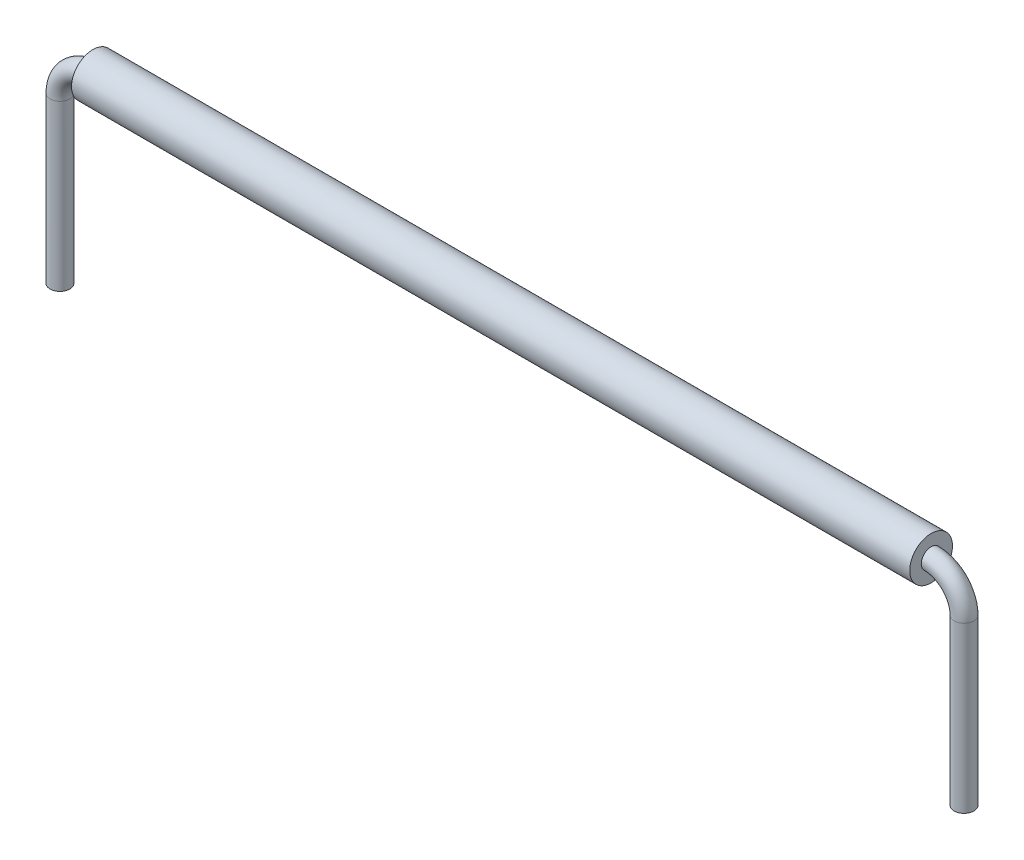
ISO-10303-21;
HEADER;
FILE_DESCRIPTION(('STEP AP214'),'2;1');
FILE_NAME('part.step','',(''),(''),'','','');
FILE_SCHEMA(('AUTOMOTIVE_DESIGN { 1 0 10303 214 1 1 1 1 }'));
ENDSEC;
DATA;
#1=APPLICATION_CONTEXT('core data for automotive mechanical design processes');
#2=APPLICATION_PROTOCOL_DEFINITION('international standard','automotive_design',2000,#1);
#3=PRODUCT_CONTEXT('',#1,'mechanical');
#4=PRODUCT('Part','Part','',(#3));
#5=PRODUCT_RELATED_PRODUCT_CATEGORY('part','',(#4));
#6=PRODUCT_DEFINITION_FORMATION('','',#4);
#7=PRODUCT_DEFINITION_CONTEXT('part definition',#1,'design');
#8=PRODUCT_DEFINITION('design','',#6,#7);
#9=PRODUCT_DEFINITION_SHAPE('','',#8);
#10=(LENGTH_UNIT() NAMED_UNIT(*) SI_UNIT(.MILLI.,.METRE.));
#11=(NAMED_UNIT(*) PLANE_ANGLE_UNIT() SI_UNIT($,.RADIAN.));
#12=(NAMED_UNIT(*) SI_UNIT($,.STERADIAN.) SOLID_ANGLE_UNIT());
#13=UNCERTAINTY_MEASURE_WITH_UNIT(LENGTH_MEASURE(1.E-05),#10,'distance_accuracy_value','');
#14=(GEOMETRIC_REPRESENTATION_CONTEXT(3) GLOBAL_UNCERTAINTY_ASSIGNED_CONTEXT((#13)) GLOBAL_UNIT_ASSIGNED_CONTEXT((#10,
#11,#12)) REPRESENTATION_CONTEXT('',''));
#15=CARTESIAN_POINT('',(0.,0.,0.));
#16=DIRECTION('',(0.,0.,1.));
#17=DIRECTION('',(1.,0.,0.));
#18=AXIS2_PLACEMENT_3D('',#15,#16,#17);
#19=CARTESIAN_POINT('',(12.7275,0.,0.));
#20=DIRECTION('',(1.,0.,0.));
#21=DIRECTION('',(0.,0.,-1.));
#22=AXIS2_PLACEMENT_3D('',#19,#20,#21);
#23=PLANE('',#22);
#24=CARTESIAN_POINT('',(12.7275,0.,0.));
#25=DIRECTION('',(1.,0.,0.));
#26=DIRECTION('',(0.,0.,-1.));
#27=AXIS2_PLACEMENT_3D('',#24,#25,#26);
#28=CIRCLE('',#27,0.65);
#29=CARTESIAN_POINT('',(12.7275,0.,-0.65));
#30=VERTEX_POINT('',#29);
#31=EDGE_CURVE('E11',#30,#30,#28,.T.);
#32=ORIENTED_EDGE('',*,*,#31,.T.);
#33=EDGE_LOOP('',(#32));
#34=FACE_BOUND('',#33,.T.);
#35=CARTESIAN_POINT('',(12.7275,0.,0.));
#36=DIRECTION('',(1.,0.,0.));
#37=DIRECTION('',(0.,0.,-1.));
#38=AXIS2_PLACEMENT_3D('',#35,#36,#37);
#39=CIRCLE('',#38,0.3);
#40=CARTESIAN_POINT('',(12.7275,0.,-0.3));
#41=VERTEX_POINT('',#40);
#42=EDGE_CURVE('E52',#41,#41,#39,.T.);
#43=ORIENTED_EDGE('',*,*,#42,.F.);
#44=EDGE_LOOP('',(#43));
#45=FACE_BOUND('',#44,.T.);
#46=ADVANCED_FACE('F45',(#34,#45),#23,.T.);
#47=CARTESIAN_POINT('',(12.7275,0.,0.));
#48=DIRECTION('',(-1.,0.,0.));
#49=DIRECTION('',(0.,0.,1.));
#50=AXIS2_PLACEMENT_3D('',#47,#48,#49);
#51=CYLINDRICAL_SURFACE('',#50,0.65);
#52=ORIENTED_EDGE('',*,*,#31,.F.);
#53=EDGE_LOOP('',(#52));
#54=FACE_BOUND('',#53,.T.);
#55=CARTESIAN_POINT('',(-12.7275,0.,0.));
#56=DIRECTION('',(1.,0.,0.));
#57=DIRECTION('',(0.,0.,-1.));
#58=AXIS2_PLACEMENT_3D('',#55,#56,#57);
#59=CIRCLE('',#58,0.65);
#60=CARTESIAN_POINT('',(-12.7275,0.,-0.65));
#61=VERTEX_POINT('',#60);
#62=EDGE_CURVE('E56',#61,#61,#59,.T.);
#63=ORIENTED_EDGE('',*,*,#62,.T.);
#64=EDGE_LOOP('',(#63));
#65=FACE_BOUND('',#64,.T.);
#66=ADVANCED_FACE('F47',(#54,#65),#51,.T.);
#67=CARTESIAN_POINT('',(12.7275,0.,0.));
#68=DIRECTION('',(-1.,0.,0.));
#69=DIRECTION('',(0.,0.,1.));
#70=AXIS2_PLACEMENT_3D('',#67,#68,#69);
#71=CYLINDRICAL_SURFACE('',#70,0.3);
#72=ORIENTED_EDGE('',*,*,#42,.T.);
#73=EDGE_LOOP('',(#72));
#74=FACE_BOUND('',#73,.T.);
#75=CARTESIAN_POINT('',(-12.7275,0.,0.));
#76=DIRECTION('',(1.,0.,0.));
#77=DIRECTION('',(0.,0.,-1.));
#78=AXIS2_PLACEMENT_3D('',#75,#76,#77);
#79=CIRCLE('',#78,0.3);
#80=CARTESIAN_POINT('',(-12.7275,0.,-0.3));
#81=VERTEX_POINT('',#80);
#82=EDGE_CURVE('E60',#81,#81,#79,.T.);
#83=ORIENTED_EDGE('',*,*,#82,.F.);
#84=EDGE_LOOP('',(#83));
#85=FACE_BOUND('',#84,.T.);
#86=ADVANCED_FACE('F69',(#74,#85),#71,.F.);
#87=CARTESIAN_POINT('',(-12.7275,0.,0.));
#88=DIRECTION('',(1.,0.,0.));
#89=DIRECTION('',(0.,0.,-1.));
#90=AXIS2_PLACEMENT_3D('',#87,#88,#89);
#91=PLANE('',#90);
#92=ORIENTED_EDGE('',*,*,#82,.T.);
#93=EDGE_LOOP('',(#92));
#94=FACE_BOUND('',#93,.T.);
#95=ORIENTED_EDGE('',*,*,#62,.F.);
#96=EDGE_LOOP('',(#95));
#97=FACE_BOUND('',#96,.T.);
#98=ADVANCED_FACE('F66',(#94,#97),#91,.F.);
#99=CLOSED_SHELL('',(#46,#66,#86,#98));
#100=MANIFOLD_SOLID_BREP('B2',#99);
#101=CARTESIAN_POINT('',(13.7275,-6.,0.));
#102=DIRECTION('',(0.,-1.,0.));
#103=DIRECTION('',(0.,0.,-1.));
#104=AXIS2_PLACEMENT_3D('',#101,#102,#103);
#105=PLANE('',#104);
#106=CARTESIAN_POINT('',(13.7275,-6.,0.));
#107=DIRECTION('',(0.,-1.,0.));
#108=DIRECTION('',(0.,0.,-1.));
#109=AXIS2_PLACEMENT_3D('',#106,#107,#108);
#110=CIRCLE('',#109,0.3);
#111=CARTESIAN_POINT('',(13.7275,-6.,-0.3));
#112=VERTEX_POINT('',#111);
#113=EDGE_CURVE('E129',#112,#112,#110,.T.);
#114=ORIENTED_EDGE('',*,*,#113,.T.);
#115=EDGE_LOOP('',(#114));
#116=FACE_BOUND('',#115,.T.);
#117=ADVANCED_FACE('F107',(#116),#105,.T.);
#118=CARTESIAN_POINT('',(-13.7275,-6.,0.));
#119=DIRECTION('',(0.,1.,0.));
#120=DIRECTION('',(0.,0.,-1.));
#121=AXIS2_PLACEMENT_3D('',#118,#119,#120);
#122=PLANE('',#121);
#123=CARTESIAN_POINT('',(-13.7275,-6.,0.));
#124=DIRECTION('',(0.,1.,0.));
#125=DIRECTION('',(0.,0.,-1.));
#126=AXIS2_PLACEMENT_3D('',#123,#124,#125);
#127=CIRCLE('',#126,0.3);
#128=CARTESIAN_POINT('',(-13.7275,-6.,-0.3));
#129=VERTEX_POINT('',#128);
#130=EDGE_CURVE('E44',#129,#129,#127,.T.);
#131=ORIENTED_EDGE('',*,*,#130,.F.);
#132=EDGE_LOOP('',(#131));
#133=FACE_BOUND('',#132,.T.);
#134=ADVANCED_FACE('F137',(#133),#122,.F.);
#135=CARTESIAN_POINT('',(13.7275,-6.,0.));
#136=DIRECTION('',(0.,1.,0.));
#137=DIRECTION('',(-1.,0.,0.));
#138=AXIS2_PLACEMENT_3D('',#135,#136,#137);
#139=CYLINDRICAL_SURFACE('',#138,0.3);
#140=CARTESIAN_POINT('',(13.7275,-0.999999999999997,0.));
#141=DIRECTION('',(0.,-1.,0.));
#142=DIRECTION('',(0.,0.,-1.));
#143=AXIS2_PLACEMENT_3D('',#140,#141,#142);
#144=CIRCLE('',#143,0.3);
#145=CARTESIAN_POINT('',(14.0275,-0.999999999999997,0.));
#146=VERTEX_POINT('',#145);
#147=EDGE_CURVE('E126',#146,#146,#144,.T.);
#148=ORIENTED_EDGE('',*,*,#147,.T.);
#149=EDGE_LOOP('',(#148));
#150=FACE_BOUND('',#149,.T.);
#151=ORIENTED_EDGE('',*,*,#113,.F.);
#152=EDGE_LOOP('',(#151));
#153=FACE_BOUND('',#152,.T.);
#154=ADVANCED_FACE('F134',(#150,#153),#139,.T.);
#155=CARTESIAN_POINT('',(12.7275,-0.999999999999997,0.));
#156=DIRECTION('',(0.,0.,1.));
#157=DIRECTION('',(1.,0.,0.));
#158=AXIS2_PLACEMENT_3D('',#155,#156,#157);
#159=TOROIDAL_SURFACE('',#158,0.999999999999999,0.3);
#160=CARTESIAN_POINT('',(12.7275,0.,0.));
#161=DIRECTION('',(1.,0.,0.));
#162=DIRECTION('',(0.,0.,-1.));
#163=AXIS2_PLACEMENT_3D('',#160,#161,#162);
#164=CIRCLE('',#163,0.3);
#165=CARTESIAN_POINT('',(12.7275,0.300000000000002,0.));
#166=VERTEX_POINT('',#165);
#167=EDGE_CURVE('E121',#166,#166,#164,.T.);
#168=CARTESIAN_POINT('',(12.7275,-0.999999999999997,0.));
#169=DIRECTION('',(0.,0.,1.));
#170=DIRECTION('',(1.,0.,0.));
#171=AXIS2_PLACEMENT_3D('',#168,#169,#170);
#172=CIRCLE('',#171,1.3);
#173=EDGE_CURVE('',#146,#166,#172,.T.);
#174=ORIENTED_EDGE('',*,*,#147,.F.);
#175=ORIENTED_EDGE('',*,*,#167,.T.);
#176=ORIENTED_EDGE('',*,*,#173,.T.);
#177=ORIENTED_EDGE('',*,*,#173,.F.);
#178=EDGE_LOOP('',(#174,#176,#175,#177));
#179=FACE_BOUND('',#178,.T.);
#180=ADVANCED_FACE('F136',(#179),#159,.T.);
#181=CARTESIAN_POINT('',(12.7275,0.,0.));
#182=DIRECTION('',(-1.,0.,0.));
#183=DIRECTION('',(0.,-1.,0.));
#184=AXIS2_PLACEMENT_3D('',#181,#182,#183);
#185=CYLINDRICAL_SURFACE('',#184,0.3);
#186=CARTESIAN_POINT('',(-12.7275,0.,0.));
#187=DIRECTION('',(1.,0.,0.));
#188=DIRECTION('',(0.,0.,-1.));
#189=AXIS2_PLACEMENT_3D('',#186,#187,#188);
#190=CIRCLE('',#189,0.3);
#191=CARTESIAN_POINT('',(-12.7275,0.299999999999999,0.));
#192=VERTEX_POINT('',#191);
#193=EDGE_CURVE('E117',#192,#192,#190,.T.);
#194=ORIENTED_EDGE('',*,*,#193,.T.);
#195=EDGE_LOOP('',(#194));
#196=FACE_BOUND('',#195,.T.);
#197=ORIENTED_EDGE('',*,*,#167,.F.);
#198=EDGE_LOOP('',(#197));
#199=FACE_BOUND('',#198,.T.);
#200=ADVANCED_FACE('F144',(#196,#199),#185,.T.);
#201=CARTESIAN_POINT('',(-12.7275,-1.,0.));
#202=DIRECTION('',(0.,0.,1.));
#203=DIRECTION('',(1.,0.,0.));
#204=AXIS2_PLACEMENT_3D('',#201,#202,#203);
#205=TOROIDAL_SURFACE('',#204,0.999999999999999,0.3);
#206=CARTESIAN_POINT('',(-13.7275,-1.,0.));
#207=DIRECTION('',(0.,1.,0.));
#208=DIRECTION('',(0.,0.,-1.));
#209=AXIS2_PLACEMENT_3D('',#206,#207,#208);
#210=CIRCLE('',#209,0.3);
#211=CARTESIAN_POINT('',(-14.0275,-1.,0.));
#212=VERTEX_POINT('',#211);
#213=EDGE_CURVE('E113',#212,#212,#210,.T.);
#214=CARTESIAN_POINT('',(-12.7275,-1.,0.));
#215=DIRECTION('',(0.,0.,1.));
#216=DIRECTION('',(1.,0.,0.));
#217=AXIS2_PLACEMENT_3D('',#214,#215,#216);
#218=CIRCLE('',#217,1.3);
#219=EDGE_CURVE('',#192,#212,#218,.T.);
#220=ORIENTED_EDGE('',*,*,#193,.F.);
#221=ORIENTED_EDGE('',*,*,#213,.T.);
#222=ORIENTED_EDGE('',*,*,#219,.T.);
#223=ORIENTED_EDGE('',*,*,#219,.F.);
#224=EDGE_LOOP('',(#220,#222,#221,#223));
#225=FACE_BOUND('',#224,.T.);
#226=ADVANCED_FACE('F150',(#225),#205,.T.);
#227=CARTESIAN_POINT('',(-13.7275,-1.,0.));
#228=DIRECTION('',(0.,-1.,0.));
#229=DIRECTION('',(1.,0.,0.));
#230=AXIS2_PLACEMENT_3D('',#227,#228,#229);
#231=CYLINDRICAL_SURFACE('',#230,0.3);
#232=ORIENTED_EDGE('',*,*,#130,.T.);
#233=EDGE_LOOP('',(#232));
#234=FACE_BOUND('',#233,.T.);
#235=ORIENTED_EDGE('',*,*,#213,.F.);
#236=EDGE_LOOP('',(#235));
#237=FACE_BOUND('',#236,.T.);
#238=ADVANCED_FACE('F148',(#234,#237),#231,.T.);
#239=CLOSED_SHELL('',(#117,#134,#154,#180,#200,#226,#238));
#240=MANIFOLD_SOLID_BREP('B6',#239);
#241=ADVANCED_BREP_SHAPE_REPRESENTATION('',(#18,#100,#240),#14);
#242=SHAPE_DEFINITION_REPRESENTATION(#9,#241);
ENDSEC;
END-ISO-10303-21;
